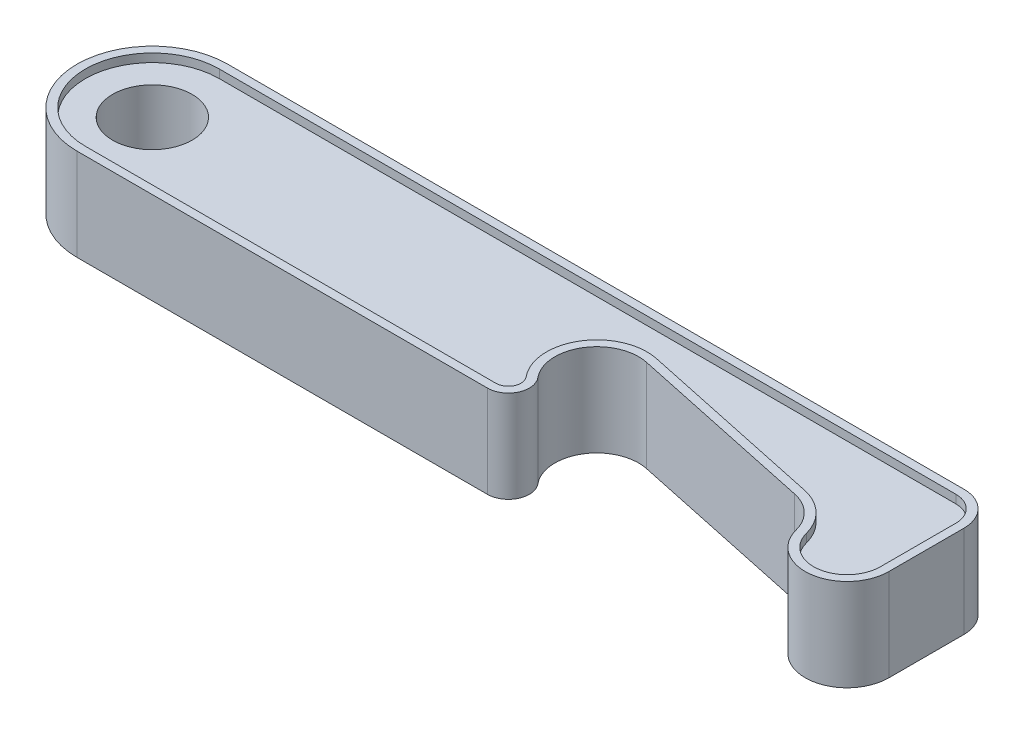
ISO-10303-21;
HEADER;
FILE_DESCRIPTION(('STEP AP214'),'2;1');
FILE_NAME('part.step','',(''),(''),'','','');
FILE_SCHEMA(('AUTOMOTIVE_DESIGN { 1 0 10303 214 1 1 1 1 }'));
ENDSEC;
DATA;
#1=APPLICATION_CONTEXT('core data for automotive mechanical design processes');
#2=APPLICATION_PROTOCOL_DEFINITION('international standard','automotive_design',2000,#1);
#3=PRODUCT_CONTEXT('',#1,'mechanical');
#4=PRODUCT('Part','Part','',(#3));
#5=PRODUCT_RELATED_PRODUCT_CATEGORY('part','',(#4));
#6=PRODUCT_DEFINITION_FORMATION('','',#4);
#7=PRODUCT_DEFINITION_CONTEXT('part definition',#1,'design');
#8=PRODUCT_DEFINITION('design','',#6,#7);
#9=PRODUCT_DEFINITION_SHAPE('','',#8);
#10=(LENGTH_UNIT() NAMED_UNIT(*) SI_UNIT(.MILLI.,.METRE.));
#11=(NAMED_UNIT(*) PLANE_ANGLE_UNIT() SI_UNIT($,.RADIAN.));
#12=(NAMED_UNIT(*) SI_UNIT($,.STERADIAN.) SOLID_ANGLE_UNIT());
#13=UNCERTAINTY_MEASURE_WITH_UNIT(LENGTH_MEASURE(1.E-05),#10,'distance_accuracy_value','');
#14=(GEOMETRIC_REPRESENTATION_CONTEXT(3) GLOBAL_UNCERTAINTY_ASSIGNED_CONTEXT((#13)) GLOBAL_UNIT_ASSIGNED_CONTEXT((#10,
#11,#12)) REPRESENTATION_CONTEXT('',''));
#15=CARTESIAN_POINT('',(0.,0.,0.));
#16=DIRECTION('',(0.,0.,1.));
#17=DIRECTION('',(1.,0.,0.));
#18=AXIS2_PLACEMENT_3D('',#15,#16,#17);
#19=CARTESIAN_POINT('',(0.,9.,0.));
#20=DIRECTION('',(0.,1.,0.));
#21=DIRECTION('',(0.,0.,1.));
#22=AXIS2_PLACEMENT_3D('',#19,#20,#21);
#23=PLANE('',#22);
#24=CARTESIAN_POINT('',(88.,9.,-5.));
#25=DIRECTION('',(0.,1.,0.));
#26=DIRECTION('',(0.,0.,1.));
#27=AXIS2_PLACEMENT_3D('',#24,#25,#26);
#28=CIRCLE('',#27,3.00000000000001);
#29=CARTESIAN_POINT('',(91.,9.,-5.));
#30=VERTEX_POINT('',#29);
#31=CARTESIAN_POINT('',(88.,9.,-8.00000000000001));
#32=VERTEX_POINT('',#31);
#33=EDGE_CURVE('E63',#30,#32,#28,.T.);
#34=ORIENTED_EDGE('',*,*,#33,.T.);
#35=DIRECTION('',(-1.,0.,0.));
#36=VECTOR('',#35,1.);
#37=CARTESIAN_POINT('',(88.,9.,-8.00000000000001));
#38=LINE('',#37,#36);
#39=CARTESIAN_POINT('',(0.,9.,-8.));
#40=VERTEX_POINT('',#39);
#41=EDGE_CURVE('E373',#32,#40,#38,.T.);
#42=ORIENTED_EDGE('',*,*,#41,.T.);
#43=CARTESIAN_POINT('',(0.,9.,0.));
#44=DIRECTION('',(0.,1.,0.));
#45=DIRECTION('',(0.,0.,1.));
#46=AXIS2_PLACEMENT_3D('',#43,#44,#45);
#47=CIRCLE('',#46,8.);
#48=CARTESIAN_POINT('',(0.,9.,8.));
#49=VERTEX_POINT('',#48);
#50=EDGE_CURVE('E375',#40,#49,#47,.T.);
#51=ORIENTED_EDGE('',*,*,#50,.T.);
#52=DIRECTION('',(1.,0.,0.));
#53=VECTOR('',#52,1.);
#54=CARTESIAN_POINT('',(0.,9.,8.));
#55=LINE('',#54,#53);
#56=CARTESIAN_POINT('',(49.0402172346334,9.,8.));
#57=VERTEX_POINT('',#56);
#58=EDGE_CURVE('E377',#49,#57,#55,.T.);
#59=ORIENTED_EDGE('',*,*,#58,.T.);
#60=CARTESIAN_POINT('',(49.0402172346334,9.,6.5));
#61=DIRECTION('',(0.,1.,0.));
#62=DIRECTION('',(0.,0.,1.));
#63=AXIS2_PLACEMENT_3D('',#60,#61,#62);
#64=CIRCLE('',#63,1.5);
#65=CARTESIAN_POINT('',(50.195682114603,9.,5.54349547248494));
#66=VERTEX_POINT('',#65);
#67=EDGE_CURVE('E379',#57,#66,#64,.T.);
#68=ORIENTED_EDGE('',*,*,#67,.T.);
#69=CARTESIAN_POINT('',(54.8175416344815,9.,1.71747736242467));
#70=DIRECTION('',(0.,-1.,0.));
#71=DIRECTION('',(0.,0.,1.));
#72=AXIS2_PLACEMENT_3D('',#69,#70,#71);
#73=CIRCLE('',#72,6.);
#74=CARTESIAN_POINT('',(56.065011779388,9.,-4.15140824197818));
#75=VERTEX_POINT('',#74);
#76=EDGE_CURVE('E381',#66,#75,#73,.T.);
#77=ORIENTED_EDGE('',*,*,#76,.T.);
#78=DIRECTION('',(0.978147600733807,0.,0.207911690817753));
#79=VECTOR('',#78,1.);
#80=CARTESIAN_POINT('',(56.065011779388,9.,-4.15140824197817));
#81=LINE('',#80,#79);
#82=CARTESIAN_POINT('',(78.565011779388,9.,0.631114395597155));
#83=VERTEX_POINT('',#82);
#84=EDGE_CURVE('E383',#75,#83,#81,.T.);
#85=ORIENTED_EDGE('',*,*,#84,.T.);
#86=CARTESIAN_POINT('',(77.3175416344814,9.,6.5));
#87=DIRECTION('',(0.,-1.,0.));
#88=DIRECTION('',(0.,0.,1.));
#89=AXIS2_PLACEMENT_3D('',#86,#87,#88);
#90=CIRCLE('',#89,6.);
#91=CARTESIAN_POINT('',(83.1270166537926,9.,5.));
#92=VERTEX_POINT('',#91);
#93=EDGE_CURVE('E385',#83,#92,#90,.T.);
#94=ORIENTED_EDGE('',*,*,#93,.T.);
#95=CARTESIAN_POINT('',(87.,9.,4.));
#96=DIRECTION('',(0.,1.,0.));
#97=DIRECTION('',(0.,0.,1.));
#98=AXIS2_PLACEMENT_3D('',#95,#96,#97);
#99=CIRCLE('',#98,4.);
#100=CARTESIAN_POINT('',(91.,9.,4.));
#101=VERTEX_POINT('',#100);
#102=EDGE_CURVE('E387',#92,#101,#99,.T.);
#103=ORIENTED_EDGE('',*,*,#102,.T.);
#104=DIRECTION('',(0.,0.,-1.));
#105=VECTOR('',#104,1.);
#106=CARTESIAN_POINT('',(91.,9.,4.));
#107=LINE('',#106,#105);
#108=EDGE_CURVE('E352',#101,#30,#107,.T.);
#109=ORIENTED_EDGE('',*,*,#108,.T.);
#110=EDGE_LOOP('',(#34,#42,#51,#59,#68,#77,#85,#94,#103,#109));
#111=FACE_BOUND('',#110,.T.);
#112=CARTESIAN_POINT('',(0.,9.,0.));
#113=DIRECTION('',(0.,1.,0.));
#114=DIRECTION('',(0.,0.,1.));
#115=AXIS2_PLACEMENT_3D('',#112,#113,#114);
#116=CIRCLE('',#115,4.75);
#117=CARTESIAN_POINT('',(0.,9.,4.75));
#118=VERTEX_POINT('',#117);
#119=EDGE_CURVE('E450',#118,#118,#116,.T.);
#120=ORIENTED_EDGE('',*,*,#119,.F.);
#121=EDGE_LOOP('',(#120));
#122=FACE_BOUND('',#121,.T.);
#123=ADVANCED_FACE('F40',(#111,#122),#23,.T.);
#124=CARTESIAN_POINT('',(0.,0.,0.));
#125=DIRECTION('',(0.,1.,0.));
#126=DIRECTION('',(0.,0.,1.));
#127=AXIS2_PLACEMENT_3D('',#124,#125,#126);
#128=PLANE('',#127);
#129=CARTESIAN_POINT('',(54.8175416344815,0.,1.71747736242467));
#130=DIRECTION('',(0.,1.,0.));
#131=DIRECTION('',(0.,0.,-1.));
#132=AXIS2_PLACEMENT_3D('',#129,#130,#131);
#133=CIRCLE('',#132,6.);
#134=CARTESIAN_POINT('',(56.065011779388,0.,-4.15140824197817));
#135=VERTEX_POINT('',#134);
#136=CARTESIAN_POINT('',(50.195682114603,0.,5.54349547248494));
#137=VERTEX_POINT('',#136);
#138=EDGE_CURVE('E246',#135,#137,#133,.T.);
#139=ORIENTED_EDGE('',*,*,#138,.T.);
#140=CARTESIAN_POINT('',(49.0402172346334,0.,6.5));
#141=DIRECTION('',(0.,-1.,0.));
#142=DIRECTION('',(0.,0.,-1.));
#143=AXIS2_PLACEMENT_3D('',#140,#141,#142);
#144=CIRCLE('',#143,1.5);
#145=CARTESIAN_POINT('',(49.0402172346334,0.,8.00000000000001));
#146=VERTEX_POINT('',#145);
#147=EDGE_CURVE('E278',#137,#146,#144,.T.);
#148=ORIENTED_EDGE('',*,*,#147,.T.);
#149=DIRECTION('',(-1.,0.,0.));
#150=VECTOR('',#149,1.);
#151=CARTESIAN_POINT('',(49.0402172346334,0.,8.00000000000001));
#152=LINE('',#151,#150);
#153=CARTESIAN_POINT('',(0.,0.,8.));
#154=VERTEX_POINT('',#153);
#155=EDGE_CURVE('E252',#146,#154,#152,.T.);
#156=ORIENTED_EDGE('',*,*,#155,.T.);
#157=CARTESIAN_POINT('',(0.,0.,0.));
#158=DIRECTION('',(0.,-1.,0.));
#159=DIRECTION('',(0.,0.,-1.));
#160=AXIS2_PLACEMENT_3D('',#157,#158,#159);
#161=CIRCLE('',#160,8.);
#162=CARTESIAN_POINT('',(0.,0.,-8.));
#163=VERTEX_POINT('',#162);
#164=EDGE_CURVE('E281',#154,#163,#161,.T.);
#165=ORIENTED_EDGE('',*,*,#164,.T.);
#166=DIRECTION('',(1.,0.,0.));
#167=VECTOR('',#166,1.);
#168=CARTESIAN_POINT('',(0.,0.,-8.));
#169=LINE('',#168,#167);
#170=CARTESIAN_POINT('',(88.,0.,-7.99999999999999));
#171=VERTEX_POINT('',#170);
#172=EDGE_CURVE('E284',#163,#171,#169,.T.);
#173=ORIENTED_EDGE('',*,*,#172,.T.);
#174=CARTESIAN_POINT('',(88.,0.,-5.));
#175=DIRECTION('',(0.,-1.,0.));
#176=DIRECTION('',(0.,0.,-1.));
#177=AXIS2_PLACEMENT_3D('',#174,#175,#176);
#178=CIRCLE('',#177,3.);
#179=CARTESIAN_POINT('',(91.,0.,-5.));
#180=VERTEX_POINT('',#179);
#181=EDGE_CURVE('E287',#171,#180,#178,.T.);
#182=ORIENTED_EDGE('',*,*,#181,.T.);
#183=DIRECTION('',(0.,0.,1.));
#184=VECTOR('',#183,1.);
#185=CARTESIAN_POINT('',(91.,0.,-5.));
#186=LINE('',#185,#184);
#187=CARTESIAN_POINT('',(91.,0.,4.));
#188=VERTEX_POINT('',#187);
#189=EDGE_CURVE('E290',#180,#188,#186,.T.);
#190=ORIENTED_EDGE('',*,*,#189,.T.);
#191=CARTESIAN_POINT('',(87.,0.,4.));
#192=DIRECTION('',(0.,-1.,0.));
#193=DIRECTION('',(0.,0.,-1.));
#194=AXIS2_PLACEMENT_3D('',#191,#192,#193);
#195=CIRCLE('',#194,4.);
#196=CARTESIAN_POINT('',(83.1270166537926,0.,5.));
#197=VERTEX_POINT('',#196);
#198=EDGE_CURVE('E293',#188,#197,#195,.T.);
#199=ORIENTED_EDGE('',*,*,#198,.T.);
#200=CARTESIAN_POINT('',(77.3175416344814,0.,6.5));
#201=DIRECTION('',(0.,1.,0.));
#202=DIRECTION('',(0.,0.,-1.));
#203=AXIS2_PLACEMENT_3D('',#200,#201,#202);
#204=CIRCLE('',#203,6.);
#205=CARTESIAN_POINT('',(78.565011779388,0.,0.631114395597154));
#206=VERTEX_POINT('',#205);
#207=EDGE_CURVE('E296',#197,#206,#204,.T.);
#208=ORIENTED_EDGE('',*,*,#207,.T.);
#209=DIRECTION('',(-0.978147600733807,0.,-0.207911690817752));
#210=VECTOR('',#209,1.);
#211=CARTESIAN_POINT('',(78.565011779388,0.,0.631114395597158));
#212=LINE('',#211,#210);
#213=EDGE_CURVE('E299',#206,#135,#212,.T.);
#214=ORIENTED_EDGE('',*,*,#213,.T.);
#215=EDGE_LOOP('',(#139,#148,#156,#165,#173,#182,#190,#199,#208,#214));
#216=FACE_BOUND('',#215,.T.);
#217=CARTESIAN_POINT('',(0.,0.,0.));
#218=DIRECTION('',(0.,1.,0.));
#219=DIRECTION('',(0.,0.,1.));
#220=AXIS2_PLACEMENT_3D('',#217,#218,#219);
#221=CIRCLE('',#220,4.75);
#222=CARTESIAN_POINT('',(0.,0.,4.75));
#223=VERTEX_POINT('',#222);
#224=EDGE_CURVE('E449',#223,#223,#221,.T.);
#225=ORIENTED_EDGE('',*,*,#224,.T.);
#226=EDGE_LOOP('',(#225));
#227=FACE_BOUND('',#226,.T.);
#228=ADVANCED_FACE('F521',(#216,#227),#128,.F.);
#229=CARTESIAN_POINT('',(0.,9.,0.));
#230=DIRECTION('',(0.,-1.,0.));
#231=DIRECTION('',(0.,0.,-1.));
#232=AXIS2_PLACEMENT_3D('',#229,#230,#231);
#233=CYLINDRICAL_SURFACE('',#232,9.);
#234=DIRECTION('',(0.,-1.,0.));
#235=VECTOR('',#234,1.);
#236=CARTESIAN_POINT('',(0.,9.,-9.));
#237=LINE('',#236,#235);
#238=CARTESIAN_POINT('',(0.,10.,-9.));
#239=VERTEX_POINT('',#238);
#240=CARTESIAN_POINT('',(0.,-1.,-9.));
#241=VERTEX_POINT('',#240);
#242=EDGE_CURVE('E453',#239,#241,#237,.T.);
#243=ORIENTED_EDGE('',*,*,#242,.T.);
#244=CARTESIAN_POINT('',(0.,-1.,0.));
#245=DIRECTION('',(0.,-1.,0.));
#246=DIRECTION('',(0.,0.,-1.));
#247=AXIS2_PLACEMENT_3D('',#244,#245,#246);
#248=CIRCLE('',#247,9.);
#249=CARTESIAN_POINT('',(0.,-1.,9.));
#250=VERTEX_POINT('',#249);
#251=EDGE_CURVE('E253',#250,#241,#248,.T.);
#252=ORIENTED_EDGE('',*,*,#251,.F.);
#253=DIRECTION('',(0.,-1.,0.));
#254=VECTOR('',#253,1.);
#255=CARTESIAN_POINT('',(0.,9.,9.));
#256=LINE('',#255,#254);
#257=CARTESIAN_POINT('',(0.,10.,9.));
#258=VERTEX_POINT('',#257);
#259=EDGE_CURVE('E11',#258,#250,#256,.T.);
#260=ORIENTED_EDGE('',*,*,#259,.F.);
#261=CARTESIAN_POINT('',(0.,10.,0.));
#262=DIRECTION('',(0.,1.,0.));
#263=DIRECTION('',(0.,0.,1.));
#264=AXIS2_PLACEMENT_3D('',#261,#262,#263);
#265=CIRCLE('',#264,9.);
#266=EDGE_CURVE('E419',#239,#258,#265,.T.);
#267=ORIENTED_EDGE('',*,*,#266,.F.);
#268=EDGE_LOOP('',(#243,#252,#260,#267));
#269=FACE_BOUND('',#268,.T.);
#270=ADVANCED_FACE('F42',(#269),#233,.T.);
#271=CARTESIAN_POINT('',(0.,9.,9.));
#272=DIRECTION('',(0.,0.,-1.));
#273=DIRECTION('',(-1.,0.,0.));
#274=AXIS2_PLACEMENT_3D('',#271,#272,#273);
#275=PLANE('',#274);
#276=ORIENTED_EDGE('',*,*,#259,.T.);
#277=DIRECTION('',(-1.,0.,0.));
#278=VECTOR('',#277,1.);
#279=CARTESIAN_POINT('',(49.0402172346334,-1.,9.));
#280=LINE('',#279,#278);
#281=CARTESIAN_POINT('',(49.0402172346334,-1.,9.));
#282=VERTEX_POINT('',#281);
#283=EDGE_CURVE('E346',#282,#250,#280,.T.);
#284=ORIENTED_EDGE('',*,*,#283,.F.);
#285=DIRECTION('',(0.,-1.,0.));
#286=VECTOR('',#285,1.);
#287=CARTESIAN_POINT('',(49.0402172346334,9.,9.));
#288=LINE('',#287,#286);
#289=CARTESIAN_POINT('',(49.0402172346334,10.,9.));
#290=VERTEX_POINT('',#289);
#291=EDGE_CURVE('E48',#290,#282,#288,.T.);
#292=ORIENTED_EDGE('',*,*,#291,.F.);
#293=DIRECTION('',(1.,0.,0.));
#294=VECTOR('',#293,1.);
#295=CARTESIAN_POINT('',(0.,10.,9.));
#296=LINE('',#295,#294);
#297=EDGE_CURVE('E422',#258,#290,#296,.T.);
#298=ORIENTED_EDGE('',*,*,#297,.F.);
#299=EDGE_LOOP('',(#276,#284,#292,#298));
#300=FACE_BOUND('',#299,.T.);
#301=ADVANCED_FACE('F480',(#300),#275,.F.);
#302=CARTESIAN_POINT('',(49.0402172346334,9.,6.5));
#303=DIRECTION('',(0.,-1.,0.));
#304=DIRECTION('',(0.,0.,-1.));
#305=AXIS2_PLACEMENT_3D('',#302,#303,#304);
#306=CYLINDRICAL_SURFACE('',#305,2.5);
#307=ORIENTED_EDGE('',*,*,#291,.T.);
#308=CARTESIAN_POINT('',(49.0402172346334,-1.,6.5));
#309=DIRECTION('',(0.,-1.,0.));
#310=DIRECTION('',(0.,0.,-1.));
#311=AXIS2_PLACEMENT_3D('',#308,#309,#310);
#312=CIRCLE('',#311,2.5);
#313=CARTESIAN_POINT('',(50.9659920345828,-1.,4.90582578747489));
#314=VERTEX_POINT('',#313);
#315=EDGE_CURVE('E343',#314,#282,#312,.T.);
#316=ORIENTED_EDGE('',*,*,#315,.F.);
#317=DIRECTION('',(0.,-1.,0.));
#318=VECTOR('',#317,1.);
#319=CARTESIAN_POINT('',(50.9659920345828,9.,4.90582578747489));
#320=LINE('',#319,#318);
#321=CARTESIAN_POINT('',(50.9659920345828,10.,4.90582578747489));
#322=VERTEX_POINT('',#321);
#323=EDGE_CURVE('E469',#322,#314,#320,.T.);
#324=ORIENTED_EDGE('',*,*,#323,.F.);
#325=CARTESIAN_POINT('',(49.0402172346334,10.,6.5));
#326=DIRECTION('',(0.,1.,0.));
#327=DIRECTION('',(0.,0.,1.));
#328=AXIS2_PLACEMENT_3D('',#325,#326,#327);
#329=CIRCLE('',#328,2.5);
#330=EDGE_CURVE('E425',#290,#322,#329,.T.);
#331=ORIENTED_EDGE('',*,*,#330,.F.);
#332=EDGE_LOOP('',(#307,#316,#324,#331));
#333=FACE_BOUND('',#332,.T.);
#334=ADVANCED_FACE('F473',(#333),#306,.T.);
#335=CARTESIAN_POINT('',(54.8175416344815,9.,1.71747736242467));
#336=DIRECTION('',(0.,-1.,0.));
#337=DIRECTION('',(0.,0.,-1.));
#338=AXIS2_PLACEMENT_3D('',#335,#336,#337);
#339=CYLINDRICAL_SURFACE('',#338,5.);
#340=ORIENTED_EDGE('',*,*,#323,.T.);
#341=CARTESIAN_POINT('',(54.8175416344815,-1.,1.71747736242467));
#342=DIRECTION('',(0.,1.,0.));
#343=DIRECTION('',(0.,0.,-1.));
#344=AXIS2_PLACEMENT_3D('',#341,#342,#343);
#345=CIRCLE('',#344,4.99999999999999);
#346=CARTESIAN_POINT('',(55.8571000885702,-1.,-3.17326064124436));
#347=VERTEX_POINT('',#346);
#348=EDGE_CURVE('E340',#347,#314,#345,.T.);
#349=ORIENTED_EDGE('',*,*,#348,.F.);
#350=DIRECTION('',(0.,-1.,0.));
#351=VECTOR('',#350,1.);
#352=CARTESIAN_POINT('',(55.8571000885702,9.,-3.17326064124436));
#353=LINE('',#352,#351);
#354=CARTESIAN_POINT('',(55.8571000885702,10.,-3.17326064124436));
#355=VERTEX_POINT('',#354);
#356=EDGE_CURVE('E467',#355,#347,#353,.T.);
#357=ORIENTED_EDGE('',*,*,#356,.F.);
#358=CARTESIAN_POINT('',(54.8175416344815,10.,1.71747736242467));
#359=DIRECTION('',(0.,-1.,0.));
#360=DIRECTION('',(0.,0.,1.));
#361=AXIS2_PLACEMENT_3D('',#358,#359,#360);
#362=CIRCLE('',#361,4.99999999999999);
#363=EDGE_CURVE('E428',#322,#355,#362,.T.);
#364=ORIENTED_EDGE('',*,*,#363,.F.);
#365=EDGE_LOOP('',(#340,#349,#357,#364));
#366=FACE_BOUND('',#365,.T.);
#367=ADVANCED_FACE('F511',(#366),#339,.F.);
#368=CARTESIAN_POINT('',(55.8571000885702,9.,-3.17326064124437));
#369=DIRECTION('',(0.207911690817753,0.,-0.978147600733807));
#370=DIRECTION('',(-0.978147600733807,0.,-0.207911690817753));
#371=AXIS2_PLACEMENT_3D('',#368,#369,#370);
#372=PLANE('',#371);
#373=ORIENTED_EDGE('',*,*,#356,.T.);
#374=DIRECTION('',(-0.978147600733807,0.,-0.207911690817752));
#375=VECTOR('',#374,1.);
#376=CARTESIAN_POINT('',(78.3571000885702,-1.,1.60926199633096));
#377=LINE('',#376,#375);
#378=CARTESIAN_POINT('',(78.3571000885702,-1.,1.60926199633096));
#379=VERTEX_POINT('',#378);
#380=EDGE_CURVE('E337',#379,#347,#377,.T.);
#381=ORIENTED_EDGE('',*,*,#380,.F.);
#382=DIRECTION('',(0.,-1.,0.));
#383=VECTOR('',#382,1.);
#384=CARTESIAN_POINT('',(78.3571000885702,9.,1.60926199633096));
#385=LINE('',#384,#383);
#386=CARTESIAN_POINT('',(78.3571000885702,10.,1.60926199633096));
#387=VERTEX_POINT('',#386);
#388=EDGE_CURVE('E465',#387,#379,#385,.T.);
#389=ORIENTED_EDGE('',*,*,#388,.F.);
#390=DIRECTION('',(0.978147600733807,0.,0.207911690817752));
#391=VECTOR('',#390,1.);
#392=CARTESIAN_POINT('',(55.8571000885702,10.,-3.17326064124436));
#393=LINE('',#392,#391);
#394=EDGE_CURVE('E431',#355,#387,#393,.T.);
#395=ORIENTED_EDGE('',*,*,#394,.F.);
#396=EDGE_LOOP('',(#373,#381,#389,#395));
#397=FACE_BOUND('',#396,.T.);
#398=ADVANCED_FACE('F508',(#397),#372,.F.);
#399=CARTESIAN_POINT('',(77.3175416344814,9.,6.5));
#400=DIRECTION('',(0.,-1.,0.));
#401=DIRECTION('',(0.,0.,-1.));
#402=AXIS2_PLACEMENT_3D('',#399,#400,#401);
#403=CYLINDRICAL_SURFACE('',#402,5.);
#404=ORIENTED_EDGE('',*,*,#388,.T.);
#405=CARTESIAN_POINT('',(77.3175416344814,-1.,6.5));
#406=DIRECTION('',(0.,1.,0.));
#407=DIRECTION('',(0.,0.,-1.));
#408=AXIS2_PLACEMENT_3D('',#405,#406,#407);
#409=CIRCLE('',#408,5.);
#410=CARTESIAN_POINT('',(82.1587708172407,-1.,5.25));
#411=VERTEX_POINT('',#410);
#412=EDGE_CURVE('E334',#411,#379,#409,.T.);
#413=ORIENTED_EDGE('',*,*,#412,.F.);
#414=DIRECTION('',(0.,-1.,0.));
#415=VECTOR('',#414,1.);
#416=CARTESIAN_POINT('',(82.1587708172407,9.,5.25));
#417=LINE('',#416,#415);
#418=CARTESIAN_POINT('',(82.1587708172407,10.,5.25));
#419=VERTEX_POINT('',#418);
#420=EDGE_CURVE('E463',#419,#411,#417,.T.);
#421=ORIENTED_EDGE('',*,*,#420,.F.);
#422=CARTESIAN_POINT('',(77.3175416344814,10.,6.5));
#423=DIRECTION('',(0.,-1.,0.));
#424=DIRECTION('',(0.,0.,1.));
#425=AXIS2_PLACEMENT_3D('',#422,#423,#424);
#426=CIRCLE('',#425,5.);
#427=EDGE_CURVE('E434',#387,#419,#426,.T.);
#428=ORIENTED_EDGE('',*,*,#427,.F.);
#429=EDGE_LOOP('',(#404,#413,#421,#428));
#430=FACE_BOUND('',#429,.T.);
#431=ADVANCED_FACE('F505',(#430),#403,.F.);
#432=CARTESIAN_POINT('',(87.,9.,4.));
#433=DIRECTION('',(0.,-1.,0.));
#434=DIRECTION('',(0.,0.,-1.));
#435=AXIS2_PLACEMENT_3D('',#432,#433,#434);
#436=CYLINDRICAL_SURFACE('',#435,5.00000000000001);
#437=ORIENTED_EDGE('',*,*,#420,.T.);
#438=CARTESIAN_POINT('',(87.,-1.,4.));
#439=DIRECTION('',(0.,-1.,0.));
#440=DIRECTION('',(0.,0.,-1.));
#441=AXIS2_PLACEMENT_3D('',#438,#439,#440);
#442=CIRCLE('',#441,5.00000000000001);
#443=CARTESIAN_POINT('',(92.,-1.,4.));
#444=VERTEX_POINT('',#443);
#445=EDGE_CURVE('E331',#444,#411,#442,.T.);
#446=ORIENTED_EDGE('',*,*,#445,.F.);
#447=DIRECTION('',(0.,-1.,0.));
#448=VECTOR('',#447,1.);
#449=CARTESIAN_POINT('',(92.,9.,4.));
#450=LINE('',#449,#448);
#451=CARTESIAN_POINT('',(92.,10.,4.));
#452=VERTEX_POINT('',#451);
#453=EDGE_CURVE('E461',#452,#444,#450,.T.);
#454=ORIENTED_EDGE('',*,*,#453,.F.);
#455=CARTESIAN_POINT('',(87.,10.,4.));
#456=DIRECTION('',(0.,1.,0.));
#457=DIRECTION('',(0.,0.,1.));
#458=AXIS2_PLACEMENT_3D('',#455,#456,#457);
#459=CIRCLE('',#458,5.00000000000001);
#460=EDGE_CURVE('E437',#419,#452,#459,.T.);
#461=ORIENTED_EDGE('',*,*,#460,.F.);
#462=EDGE_LOOP('',(#437,#446,#454,#461));
#463=FACE_BOUND('',#462,.T.);
#464=ADVANCED_FACE('F500',(#463),#436,.T.);
#465=CARTESIAN_POINT('',(92.,9.,4.));
#466=DIRECTION('',(-1.,0.,0.));
#467=DIRECTION('',(0.,0.,1.));
#468=AXIS2_PLACEMENT_3D('',#465,#466,#467);
#469=PLANE('',#468);
#470=ORIENTED_EDGE('',*,*,#453,.T.);
#471=DIRECTION('',(0.,0.,1.));
#472=VECTOR('',#471,1.);
#473=CARTESIAN_POINT('',(92.,-1.,-5.));
#474=LINE('',#473,#472);
#475=CARTESIAN_POINT('',(92.,-1.,-5.));
#476=VERTEX_POINT('',#475);
#477=EDGE_CURVE('E328',#476,#444,#474,.T.);
#478=ORIENTED_EDGE('',*,*,#477,.F.);
#479=DIRECTION('',(0.,-1.,0.));
#480=VECTOR('',#479,1.);
#481=CARTESIAN_POINT('',(92.,9.,-5.));
#482=LINE('',#481,#480);
#483=CARTESIAN_POINT('',(92.,10.,-5.));
#484=VERTEX_POINT('',#483);
#485=EDGE_CURVE('E459',#484,#476,#482,.T.);
#486=ORIENTED_EDGE('',*,*,#485,.F.);
#487=DIRECTION('',(0.,0.,-1.));
#488=VECTOR('',#487,1.);
#489=CARTESIAN_POINT('',(92.,10.,4.));
#490=LINE('',#489,#488);
#491=EDGE_CURVE('E440',#452,#484,#490,.T.);
#492=ORIENTED_EDGE('',*,*,#491,.F.);
#493=EDGE_LOOP('',(#470,#478,#486,#492));
#494=FACE_BOUND('',#493,.T.);
#495=ADVANCED_FACE('F492',(#494),#469,.F.);
#496=CARTESIAN_POINT('',(88.,9.,-5.));
#497=DIRECTION('',(0.,-1.,0.));
#498=DIRECTION('',(0.,0.,-1.));
#499=AXIS2_PLACEMENT_3D('',#496,#497,#498);
#500=CYLINDRICAL_SURFACE('',#499,4.);
#501=ORIENTED_EDGE('',*,*,#485,.T.);
#502=CARTESIAN_POINT('',(88.,-1.,-5.));
#503=DIRECTION('',(0.,-1.,0.));
#504=DIRECTION('',(0.,0.,-1.));
#505=AXIS2_PLACEMENT_3D('',#502,#503,#504);
#506=CIRCLE('',#505,4.);
#507=CARTESIAN_POINT('',(88.,-1.,-9.));
#508=VERTEX_POINT('',#507);
#509=EDGE_CURVE('E325',#508,#476,#506,.T.);
#510=ORIENTED_EDGE('',*,*,#509,.F.);
#511=DIRECTION('',(0.,-1.,0.));
#512=VECTOR('',#511,1.);
#513=CARTESIAN_POINT('',(88.,9.,-9.));
#514=LINE('',#513,#512);
#515=CARTESIAN_POINT('',(88.,10.,-9.));
#516=VERTEX_POINT('',#515);
#517=EDGE_CURVE('E457',#516,#508,#514,.T.);
#518=ORIENTED_EDGE('',*,*,#517,.F.);
#519=CARTESIAN_POINT('',(88.,10.,-5.));
#520=DIRECTION('',(0.,1.,0.));
#521=DIRECTION('',(0.,0.,1.));
#522=AXIS2_PLACEMENT_3D('',#519,#520,#521);
#523=CIRCLE('',#522,4.);
#524=EDGE_CURVE('E443',#484,#516,#523,.T.);
#525=ORIENTED_EDGE('',*,*,#524,.F.);
#526=EDGE_LOOP('',(#501,#510,#518,#525));
#527=FACE_BOUND('',#526,.T.);
#528=ADVANCED_FACE('F488',(#527),#500,.T.);
#529=CARTESIAN_POINT('',(0.,9.,-9.));
#530=DIRECTION('',(0.,0.,1.));
#531=DIRECTION('',(1.,0.,0.));
#532=AXIS2_PLACEMENT_3D('',#529,#530,#531);
#533=PLANE('',#532);
#534=ORIENTED_EDGE('',*,*,#517,.T.);
#535=DIRECTION('',(1.,0.,0.));
#536=VECTOR('',#535,1.);
#537=CARTESIAN_POINT('',(0.,-1.,-9.));
#538=LINE('',#537,#536);
#539=EDGE_CURVE('E322',#241,#508,#538,.T.);
#540=ORIENTED_EDGE('',*,*,#539,.F.);
#541=ORIENTED_EDGE('',*,*,#242,.F.);
#542=DIRECTION('',(-1.,0.,0.));
#543=VECTOR('',#542,1.);
#544=CARTESIAN_POINT('',(88.,10.,-9.));
#545=LINE('',#544,#543);
#546=EDGE_CURVE('E446',#516,#239,#545,.T.);
#547=ORIENTED_EDGE('',*,*,#546,.F.);
#548=EDGE_LOOP('',(#534,#540,#541,#547));
#549=FACE_BOUND('',#548,.T.);
#550=ADVANCED_FACE('F533',(#549),#533,.F.);
#551=CARTESIAN_POINT('',(0.,9.,0.));
#552=DIRECTION('',(0.,-1.,0.));
#553=DIRECTION('',(0.,0.,-1.));
#554=AXIS2_PLACEMENT_3D('',#551,#552,#553);
#555=CYLINDRICAL_SURFACE('',#554,4.75);
#556=ORIENTED_EDGE('',*,*,#119,.T.);
#557=EDGE_LOOP('',(#556));
#558=FACE_BOUND('',#557,.T.);
#559=ORIENTED_EDGE('',*,*,#224,.F.);
#560=EDGE_LOOP('',(#559));
#561=FACE_BOUND('',#560,.T.);
#562=ADVANCED_FACE('F530',(#558,#561),#555,.F.);
#563=CARTESIAN_POINT('',(0.,10.,0.));
#564=DIRECTION('',(0.,1.,0.));
#565=DIRECTION('',(0.,0.,1.));
#566=AXIS2_PLACEMENT_3D('',#563,#564,#565);
#567=PLANE('',#566);
#568=ORIENTED_EDGE('',*,*,#266,.T.);
#569=ORIENTED_EDGE('',*,*,#297,.T.);
#570=ORIENTED_EDGE('',*,*,#330,.T.);
#571=ORIENTED_EDGE('',*,*,#363,.T.);
#572=ORIENTED_EDGE('',*,*,#394,.T.);
#573=ORIENTED_EDGE('',*,*,#427,.T.);
#574=ORIENTED_EDGE('',*,*,#460,.T.);
#575=ORIENTED_EDGE('',*,*,#491,.T.);
#576=ORIENTED_EDGE('',*,*,#524,.T.);
#577=ORIENTED_EDGE('',*,*,#546,.T.);
#578=EDGE_LOOP('',(#568,#569,#570,#571,#572,#573,#574,#575,#576,#577));
#579=FACE_BOUND('',#578,.T.);
#580=DIRECTION('',(-1.,0.,0.));
#581=VECTOR('',#580,1.);
#582=CARTESIAN_POINT('',(88.,10.,-8.00000000000001));
#583=LINE('',#582,#581);
#584=CARTESIAN_POINT('',(88.,10.,-8.00000000000001));
#585=VERTEX_POINT('',#584);
#586=CARTESIAN_POINT('',(0.,10.,-8.));
#587=VERTEX_POINT('',#586);
#588=EDGE_CURVE('E351',#585,#587,#583,.T.);
#589=ORIENTED_EDGE('',*,*,#588,.F.);
#590=CARTESIAN_POINT('',(88.,10.,-5.));
#591=DIRECTION('',(0.,1.,0.));
#592=DIRECTION('',(0.,0.,1.));
#593=AXIS2_PLACEMENT_3D('',#590,#591,#592);
#594=CIRCLE('',#593,3.00000000000001);
#595=CARTESIAN_POINT('',(91.,10.,-5.));
#596=VERTEX_POINT('',#595);
#597=EDGE_CURVE('E349',#596,#585,#594,.T.);
#598=ORIENTED_EDGE('',*,*,#597,.F.);
#599=DIRECTION('',(0.,0.,-1.));
#600=VECTOR('',#599,1.);
#601=CARTESIAN_POINT('',(91.,10.,4.));
#602=LINE('',#601,#600);
#603=CARTESIAN_POINT('',(91.,10.,4.));
#604=VERTEX_POINT('',#603);
#605=EDGE_CURVE('E369',#604,#596,#602,.T.);
#606=ORIENTED_EDGE('',*,*,#605,.F.);
#607=CARTESIAN_POINT('',(87.,10.,4.));
#608=DIRECTION('',(0.,1.,0.));
#609=DIRECTION('',(0.,0.,1.));
#610=AXIS2_PLACEMENT_3D('',#607,#608,#609);
#611=CIRCLE('',#610,4.);
#612=CARTESIAN_POINT('',(83.1270166537926,10.,5.));
#613=VERTEX_POINT('',#612);
#614=EDGE_CURVE('E366',#613,#604,#611,.T.);
#615=ORIENTED_EDGE('',*,*,#614,.F.);
#616=CARTESIAN_POINT('',(77.3175416344814,10.,6.5));
#617=DIRECTION('',(0.,-1.,0.));
#618=DIRECTION('',(0.,0.,1.));
#619=AXIS2_PLACEMENT_3D('',#616,#617,#618);
#620=CIRCLE('',#619,6.);
#621=CARTESIAN_POINT('',(78.565011779388,10.,0.631114395597158));
#622=VERTEX_POINT('',#621);
#623=EDGE_CURVE('E364',#622,#613,#620,.T.);
#624=ORIENTED_EDGE('',*,*,#623,.F.);
#625=DIRECTION('',(0.978147600733807,0.,0.207911690817753));
#626=VECTOR('',#625,1.);
#627=CARTESIAN_POINT('',(56.065011779388,10.,-4.15140824197817));
#628=LINE('',#627,#626);
#629=CARTESIAN_POINT('',(56.065011779388,10.,-4.15140824197817));
#630=VERTEX_POINT('',#629);
#631=EDGE_CURVE('E362',#630,#622,#628,.T.);
#632=ORIENTED_EDGE('',*,*,#631,.F.);
#633=CARTESIAN_POINT('',(54.8175416344815,10.,1.71747736242467));
#634=DIRECTION('',(0.,-1.,0.));
#635=DIRECTION('',(0.,0.,1.));
#636=AXIS2_PLACEMENT_3D('',#633,#634,#635);
#637=CIRCLE('',#636,6.);
#638=CARTESIAN_POINT('',(50.195682114603,10.,5.54349547248494));
#639=VERTEX_POINT('',#638);
#640=EDGE_CURVE('E360',#639,#630,#637,.T.);
#641=ORIENTED_EDGE('',*,*,#640,.F.);
#642=CARTESIAN_POINT('',(49.0402172346334,10.,6.5));
#643=DIRECTION('',(0.,1.,0.));
#644=DIRECTION('',(0.,0.,1.));
#645=AXIS2_PLACEMENT_3D('',#642,#643,#644);
#646=CIRCLE('',#645,1.5);
#647=CARTESIAN_POINT('',(49.0402172346334,10.,8.));
#648=VERTEX_POINT('',#647);
#649=EDGE_CURVE('E358',#648,#639,#646,.T.);
#650=ORIENTED_EDGE('',*,*,#649,.F.);
#651=DIRECTION('',(1.,0.,0.));
#652=VECTOR('',#651,1.);
#653=CARTESIAN_POINT('',(0.,10.,8.));
#654=LINE('',#653,#652);
#655=CARTESIAN_POINT('',(0.,10.,8.));
#656=VERTEX_POINT('',#655);
#657=EDGE_CURVE('E356',#656,#648,#654,.T.);
#658=ORIENTED_EDGE('',*,*,#657,.F.);
#659=CARTESIAN_POINT('',(0.,10.,0.));
#660=DIRECTION('',(0.,1.,0.));
#661=DIRECTION('',(0.,0.,1.));
#662=AXIS2_PLACEMENT_3D('',#659,#660,#661);
#663=CIRCLE('',#662,8.);
#664=EDGE_CURVE('E354',#587,#656,#663,.T.);
#665=ORIENTED_EDGE('',*,*,#664,.F.);
#666=EDGE_LOOP('',(#589,#598,#606,#615,#624,#632,#641,#650,#658,#665));
#667=FACE_BOUND('',#666,.T.);
#668=ADVANCED_FACE('F494',(#579,#667),#567,.T.);
#669=CARTESIAN_POINT('',(88.,10.,-5.));
#670=DIRECTION('',(0.,-1.,0.));
#671=DIRECTION('',(0.,0.,-1.));
#672=AXIS2_PLACEMENT_3D('',#669,#670,#671);
#673=CYLINDRICAL_SURFACE('',#672,3.00000000000001);
#674=ORIENTED_EDGE('',*,*,#33,.F.);
#675=DIRECTION('',(0.,-1.,0.));
#676=VECTOR('',#675,1.);
#677=CARTESIAN_POINT('',(91.,10.,-5.));
#678=LINE('',#677,#676);
#679=EDGE_CURVE('E371',#596,#30,#678,.T.);
#680=ORIENTED_EDGE('',*,*,#679,.F.);
#681=ORIENTED_EDGE('',*,*,#597,.T.);
#682=DIRECTION('',(0.,-1.,0.));
#683=VECTOR('',#682,1.);
#684=CARTESIAN_POINT('',(88.,10.,-8.00000000000001));
#685=LINE('',#684,#683);
#686=EDGE_CURVE('E416',#585,#32,#685,.T.);
#687=ORIENTED_EDGE('',*,*,#686,.T.);
#688=EDGE_LOOP('',(#674,#680,#681,#687));
#689=FACE_BOUND('',#688,.T.);
#690=ADVANCED_FACE('F576',(#689),#673,.F.);
#691=CARTESIAN_POINT('',(88.,10.,-8.00000000000001));
#692=DIRECTION('',(0.,0.,1.));
#693=DIRECTION('',(1.,0.,0.));
#694=AXIS2_PLACEMENT_3D('',#691,#692,#693);
#695=PLANE('',#694);
#696=ORIENTED_EDGE('',*,*,#41,.F.);
#697=ORIENTED_EDGE('',*,*,#686,.F.);
#698=ORIENTED_EDGE('',*,*,#588,.T.);
#699=DIRECTION('',(0.,-1.,0.));
#700=VECTOR('',#699,1.);
#701=CARTESIAN_POINT('',(0.,10.,-8.));
#702=LINE('',#701,#700);
#703=EDGE_CURVE('E413',#587,#40,#702,.T.);
#704=ORIENTED_EDGE('',*,*,#703,.T.);
#705=EDGE_LOOP('',(#696,#697,#698,#704));
#706=FACE_BOUND('',#705,.T.);
#707=ADVANCED_FACE('F582',(#706),#695,.T.);
#708=CARTESIAN_POINT('',(0.,10.,0.));
#709=DIRECTION('',(0.,-1.,0.));
#710=DIRECTION('',(0.,0.,-1.));
#711=AXIS2_PLACEMENT_3D('',#708,#709,#710);
#712=CYLINDRICAL_SURFACE('',#711,8.);
#713=ORIENTED_EDGE('',*,*,#50,.F.);
#714=ORIENTED_EDGE('',*,*,#703,.F.);
#715=ORIENTED_EDGE('',*,*,#664,.T.);
#716=DIRECTION('',(0.,-1.,0.));
#717=VECTOR('',#716,1.);
#718=CARTESIAN_POINT('',(0.,10.,8.));
#719=LINE('',#718,#717);
#720=EDGE_CURVE('E410',#656,#49,#719,.T.);
#721=ORIENTED_EDGE('',*,*,#720,.T.);
#722=EDGE_LOOP('',(#713,#714,#715,#721));
#723=FACE_BOUND('',#722,.T.);
#724=ADVANCED_FACE('F590',(#723),#712,.F.);
#725=CARTESIAN_POINT('',(0.,10.,8.));
#726=DIRECTION('',(0.,0.,-1.));
#727=DIRECTION('',(-1.,0.,0.));
#728=AXIS2_PLACEMENT_3D('',#725,#726,#727);
#729=PLANE('',#728);
#730=ORIENTED_EDGE('',*,*,#58,.F.);
#731=ORIENTED_EDGE('',*,*,#720,.F.);
#732=ORIENTED_EDGE('',*,*,#657,.T.);
#733=DIRECTION('',(0.,-1.,0.));
#734=VECTOR('',#733,1.);
#735=CARTESIAN_POINT('',(49.0402172346334,10.,8.));
#736=LINE('',#735,#734);
#737=EDGE_CURVE('E407',#648,#57,#736,.T.);
#738=ORIENTED_EDGE('',*,*,#737,.T.);
#739=EDGE_LOOP('',(#730,#731,#732,#738));
#740=FACE_BOUND('',#739,.T.);
#741=ADVANCED_FACE('F598',(#740),#729,.T.);
#742=CARTESIAN_POINT('',(49.0402172346334,10.,6.5));
#743=DIRECTION('',(0.,-1.,0.));
#744=DIRECTION('',(0.,0.,-1.));
#745=AXIS2_PLACEMENT_3D('',#742,#743,#744);
#746=CYLINDRICAL_SURFACE('',#745,1.5);
#747=ORIENTED_EDGE('',*,*,#67,.F.);
#748=ORIENTED_EDGE('',*,*,#737,.F.);
#749=ORIENTED_EDGE('',*,*,#649,.T.);
#750=DIRECTION('',(0.,-1.,0.));
#751=VECTOR('',#750,1.);
#752=CARTESIAN_POINT('',(50.195682114603,10.,5.54349547248494));
#753=LINE('',#752,#751);
#754=EDGE_CURVE('E404',#639,#66,#753,.T.);
#755=ORIENTED_EDGE('',*,*,#754,.T.);
#756=EDGE_LOOP('',(#747,#748,#749,#755));
#757=FACE_BOUND('',#756,.T.);
#758=ADVANCED_FACE('F606',(#757),#746,.F.);
#759=CARTESIAN_POINT('',(54.8175416344815,10.,1.71747736242467));
#760=DIRECTION('',(0.,-1.,0.));
#761=DIRECTION('',(0.,0.,-1.));
#762=AXIS2_PLACEMENT_3D('',#759,#760,#761);
#763=CYLINDRICAL_SURFACE('',#762,6.);
#764=ORIENTED_EDGE('',*,*,#76,.F.);
#765=ORIENTED_EDGE('',*,*,#754,.F.);
#766=ORIENTED_EDGE('',*,*,#640,.T.);
#767=DIRECTION('',(0.,-1.,0.));
#768=VECTOR('',#767,1.);
#769=CARTESIAN_POINT('',(56.065011779388,10.,-4.15140824197817));
#770=LINE('',#769,#768);
#771=EDGE_CURVE('E401',#630,#75,#770,.T.);
#772=ORIENTED_EDGE('',*,*,#771,.T.);
#773=EDGE_LOOP('',(#764,#765,#766,#772));
#774=FACE_BOUND('',#773,.T.);
#775=ADVANCED_FACE('F614',(#774),#763,.T.);
#776=CARTESIAN_POINT('',(56.065011779388,10.,-4.15140824197817));
#777=DIRECTION('',(0.207911690817753,0.,-0.978147600733807));
#778=DIRECTION('',(-0.978147600733807,0.,-0.207911690817753));
#779=AXIS2_PLACEMENT_3D('',#776,#777,#778);
#780=PLANE('',#779);
#781=ORIENTED_EDGE('',*,*,#84,.F.);
#782=ORIENTED_EDGE('',*,*,#771,.F.);
#783=ORIENTED_EDGE('',*,*,#631,.T.);
#784=DIRECTION('',(0.,-1.,0.));
#785=VECTOR('',#784,1.);
#786=CARTESIAN_POINT('',(78.565011779388,10.,0.631114395597158));
#787=LINE('',#786,#785);
#788=EDGE_CURVE('E398',#622,#83,#787,.T.);
#789=ORIENTED_EDGE('',*,*,#788,.T.);
#790=EDGE_LOOP('',(#781,#782,#783,#789));
#791=FACE_BOUND('',#790,.T.);
#792=ADVANCED_FACE('F622',(#791),#780,.T.);
#793=CARTESIAN_POINT('',(77.3175416344814,10.,6.5));
#794=DIRECTION('',(0.,-1.,0.));
#795=DIRECTION('',(0.,0.,-1.));
#796=AXIS2_PLACEMENT_3D('',#793,#794,#795);
#797=CYLINDRICAL_SURFACE('',#796,6.);
#798=ORIENTED_EDGE('',*,*,#93,.F.);
#799=ORIENTED_EDGE('',*,*,#788,.F.);
#800=ORIENTED_EDGE('',*,*,#623,.T.);
#801=DIRECTION('',(0.,-1.,0.));
#802=VECTOR('',#801,1.);
#803=CARTESIAN_POINT('',(83.1270166537926,10.,5.));
#804=LINE('',#803,#802);
#805=EDGE_CURVE('E395',#613,#92,#804,.T.);
#806=ORIENTED_EDGE('',*,*,#805,.T.);
#807=EDGE_LOOP('',(#798,#799,#800,#806));
#808=FACE_BOUND('',#807,.T.);
#809=ADVANCED_FACE('F630',(#808),#797,.T.);
#810=CARTESIAN_POINT('',(87.,10.,4.));
#811=DIRECTION('',(0.,-1.,0.));
#812=DIRECTION('',(0.,0.,-1.));
#813=AXIS2_PLACEMENT_3D('',#810,#811,#812);
#814=CYLINDRICAL_SURFACE('',#813,4.);
#815=ORIENTED_EDGE('',*,*,#102,.F.);
#816=ORIENTED_EDGE('',*,*,#805,.F.);
#817=ORIENTED_EDGE('',*,*,#614,.T.);
#818=DIRECTION('',(0.,-1.,0.));
#819=VECTOR('',#818,1.);
#820=CARTESIAN_POINT('',(91.,10.,4.));
#821=LINE('',#820,#819);
#822=EDGE_CURVE('E392',#604,#101,#821,.T.);
#823=ORIENTED_EDGE('',*,*,#822,.T.);
#824=EDGE_LOOP('',(#815,#816,#817,#823));
#825=FACE_BOUND('',#824,.T.);
#826=ADVANCED_FACE('F638',(#825),#814,.F.);
#827=CARTESIAN_POINT('',(91.,10.,4.));
#828=DIRECTION('',(-1.,0.,0.));
#829=DIRECTION('',(0.,0.,1.));
#830=AXIS2_PLACEMENT_3D('',#827,#828,#829);
#831=PLANE('',#830);
#832=ORIENTED_EDGE('',*,*,#108,.F.);
#833=ORIENTED_EDGE('',*,*,#822,.F.);
#834=ORIENTED_EDGE('',*,*,#605,.T.);
#835=ORIENTED_EDGE('',*,*,#679,.T.);
#836=EDGE_LOOP('',(#832,#833,#834,#835));
#837=FACE_BOUND('',#836,.T.);
#838=ADVANCED_FACE('F646',(#837),#831,.T.);
#839=CARTESIAN_POINT('',(0.,-1.,0.));
#840=DIRECTION('',(0.,-1.,0.));
#841=DIRECTION('',(0.,0.,-1.));
#842=AXIS2_PLACEMENT_3D('',#839,#840,#841);
#843=PLANE('',#842);
#844=ORIENTED_EDGE('',*,*,#251,.T.);
#845=ORIENTED_EDGE('',*,*,#539,.T.);
#846=ORIENTED_EDGE('',*,*,#509,.T.);
#847=ORIENTED_EDGE('',*,*,#477,.T.);
#848=ORIENTED_EDGE('',*,*,#445,.T.);
#849=ORIENTED_EDGE('',*,*,#412,.T.);
#850=ORIENTED_EDGE('',*,*,#380,.T.);
#851=ORIENTED_EDGE('',*,*,#348,.T.);
#852=ORIENTED_EDGE('',*,*,#315,.T.);
#853=ORIENTED_EDGE('',*,*,#283,.T.);
#854=EDGE_LOOP('',(#844,#845,#846,#847,#848,#849,#850,#851,#852,#853));
#855=FACE_BOUND('',#854,.T.);
#856=DIRECTION('',(-1.,0.,0.));
#857=VECTOR('',#856,1.);
#858=CARTESIAN_POINT('',(49.0402172346334,-1.,8.00000000000001));
#859=LINE('',#858,#857);
#860=CARTESIAN_POINT('',(49.0402172346334,-1.,8.00000000000001));
#861=VERTEX_POINT('',#860);
#862=CARTESIAN_POINT('',(0.,-1.,8.));
#863=VERTEX_POINT('',#862);
#864=EDGE_CURVE('E245',#861,#863,#859,.T.);
#865=ORIENTED_EDGE('',*,*,#864,.F.);
#866=CARTESIAN_POINT('',(49.0402172346334,-1.,6.5));
#867=DIRECTION('',(0.,-1.,0.));
#868=DIRECTION('',(0.,0.,-1.));
#869=AXIS2_PLACEMENT_3D('',#866,#867,#868);
#870=CIRCLE('',#869,1.5);
#871=CARTESIAN_POINT('',(50.195682114603,-1.,5.54349547248494));
#872=VERTEX_POINT('',#871);
#873=EDGE_CURVE('E237',#872,#861,#870,.T.);
#874=ORIENTED_EDGE('',*,*,#873,.F.);
#875=CARTESIAN_POINT('',(54.8175416344815,-1.,1.71747736242467));
#876=DIRECTION('',(0.,1.,0.));
#877=DIRECTION('',(0.,0.,-1.));
#878=AXIS2_PLACEMENT_3D('',#875,#876,#877);
#879=CIRCLE('',#878,6.);
#880=CARTESIAN_POINT('',(56.065011779388,-1.,-4.15140824197817));
#881=VERTEX_POINT('',#880);
#882=EDGE_CURVE('E276',#881,#872,#879,.T.);
#883=ORIENTED_EDGE('',*,*,#882,.F.);
#884=DIRECTION('',(-0.978147600733807,0.,-0.207911690817752));
#885=VECTOR('',#884,1.);
#886=CARTESIAN_POINT('',(78.565011779388,-1.,0.631114395597158));
#887=LINE('',#886,#885);
#888=CARTESIAN_POINT('',(78.565011779388,-1.,0.631114395597154));
#889=VERTEX_POINT('',#888);
#890=EDGE_CURVE('E273',#889,#881,#887,.T.);
#891=ORIENTED_EDGE('',*,*,#890,.F.);
#892=CARTESIAN_POINT('',(77.3175416344814,-1.,6.5));
#893=DIRECTION('',(0.,1.,0.));
#894=DIRECTION('',(0.,0.,-1.));
#895=AXIS2_PLACEMENT_3D('',#892,#893,#894);
#896=CIRCLE('',#895,6.);
#897=CARTESIAN_POINT('',(83.1270166537926,-1.,5.));
#898=VERTEX_POINT('',#897);
#899=EDGE_CURVE('E271',#898,#889,#896,.T.);
#900=ORIENTED_EDGE('',*,*,#899,.F.);
#901=CARTESIAN_POINT('',(87.,-1.,4.));
#902=DIRECTION('',(0.,-1.,0.));
#903=DIRECTION('',(0.,0.,-1.));
#904=AXIS2_PLACEMENT_3D('',#901,#902,#903);
#905=CIRCLE('',#904,4.);
#906=CARTESIAN_POINT('',(91.,-1.,4.));
#907=VERTEX_POINT('',#906);
#908=EDGE_CURVE('E269',#907,#898,#905,.T.);
#909=ORIENTED_EDGE('',*,*,#908,.F.);
#910=DIRECTION('',(0.,0.,1.));
#911=VECTOR('',#910,1.);
#912=CARTESIAN_POINT('',(91.,-1.,-5.));
#913=LINE('',#912,#911);
#914=CARTESIAN_POINT('',(91.,-1.,-5.));
#915=VERTEX_POINT('',#914);
#916=EDGE_CURVE('E267',#915,#907,#913,.T.);
#917=ORIENTED_EDGE('',*,*,#916,.F.);
#918=CARTESIAN_POINT('',(88.,-1.,-5.));
#919=DIRECTION('',(0.,-1.,0.));
#920=DIRECTION('',(0.,0.,-1.));
#921=AXIS2_PLACEMENT_3D('',#918,#919,#920);
#922=CIRCLE('',#921,3.);
#923=CARTESIAN_POINT('',(88.,-1.,-7.99999999999999));
#924=VERTEX_POINT('',#923);
#925=EDGE_CURVE('E265',#924,#915,#922,.T.);
#926=ORIENTED_EDGE('',*,*,#925,.F.);
#927=DIRECTION('',(1.,0.,0.));
#928=VECTOR('',#927,1.);
#929=CARTESIAN_POINT('',(0.,-1.,-8.));
#930=LINE('',#929,#928);
#931=CARTESIAN_POINT('',(0.,-1.,-8.));
#932=VERTEX_POINT('',#931);
#933=EDGE_CURVE('E261',#932,#924,#930,.T.);
#934=ORIENTED_EDGE('',*,*,#933,.F.);
#935=CARTESIAN_POINT('',(0.,-1.,0.));
#936=DIRECTION('',(0.,-1.,0.));
#937=DIRECTION('',(0.,0.,-1.));
#938=AXIS2_PLACEMENT_3D('',#935,#936,#937);
#939=CIRCLE('',#938,8.);
#940=EDGE_CURVE('E259',#863,#932,#939,.T.);
#941=ORIENTED_EDGE('',*,*,#940,.F.);
#942=EDGE_LOOP('',(#865,#874,#883,#891,#900,#909,#917,#926,#934,#941));
#943=FACE_BOUND('',#942,.T.);
#944=ADVANCED_FACE('F257',(#855,#943),#843,.T.);
#945=CARTESIAN_POINT('',(49.0402172346334,-1.,6.5));
#946=DIRECTION('',(0.,1.,0.));
#947=DIRECTION('',(0.,0.,1.));
#948=AXIS2_PLACEMENT_3D('',#945,#946,#947);
#949=CYLINDRICAL_SURFACE('',#948,1.5);
#950=ORIENTED_EDGE('',*,*,#147,.F.);
#951=DIRECTION('',(0.,1.,0.));
#952=VECTOR('',#951,1.);
#953=CARTESIAN_POINT('',(50.195682114603,-1.,5.54349547248494));
#954=LINE('',#953,#952);
#955=EDGE_CURVE('E55',#872,#137,#954,.T.);
#956=ORIENTED_EDGE('',*,*,#955,.F.);
#957=ORIENTED_EDGE('',*,*,#873,.T.);
#958=DIRECTION('',(0.,1.,0.));
#959=VECTOR('',#958,1.);
#960=CARTESIAN_POINT('',(49.0402172346334,-1.,8.00000000000001));
#961=LINE('',#960,#959);
#962=EDGE_CURVE('E240',#861,#146,#961,.T.);
#963=ORIENTED_EDGE('',*,*,#962,.T.);
#964=EDGE_LOOP('',(#950,#956,#957,#963));
#965=FACE_BOUND('',#964,.T.);
#966=ADVANCED_FACE('F239',(#965),#949,.F.);
#967=CARTESIAN_POINT('',(49.0402172346334,-1.,8.00000000000001));
#968=DIRECTION('',(0.,0.,-1.));
#969=DIRECTION('',(-1.,0.,0.));
#970=AXIS2_PLACEMENT_3D('',#967,#968,#969);
#971=PLANE('',#970);
#972=ORIENTED_EDGE('',*,*,#155,.F.);
#973=ORIENTED_EDGE('',*,*,#962,.F.);
#974=ORIENTED_EDGE('',*,*,#864,.T.);
#975=DIRECTION('',(0.,1.,0.));
#976=VECTOR('',#975,1.);
#977=CARTESIAN_POINT('',(0.,-1.,8.));
#978=LINE('',#977,#976);
#979=EDGE_CURVE('E254',#863,#154,#978,.T.);
#980=ORIENTED_EDGE('',*,*,#979,.T.);
#981=EDGE_LOOP('',(#972,#973,#974,#980));
#982=FACE_BOUND('',#981,.T.);
#983=ADVANCED_FACE('F249',(#982),#971,.T.);
#984=CARTESIAN_POINT('',(0.,-1.,0.));
#985=DIRECTION('',(0.,1.,0.));
#986=DIRECTION('',(0.,0.,1.));
#987=AXIS2_PLACEMENT_3D('',#984,#985,#986);
#988=CYLINDRICAL_SURFACE('',#987,8.);
#989=ORIENTED_EDGE('',*,*,#164,.F.);
#990=ORIENTED_EDGE('',*,*,#979,.F.);
#991=ORIENTED_EDGE('',*,*,#940,.T.);
#992=DIRECTION('',(0.,1.,0.));
#993=VECTOR('',#992,1.);
#994=CARTESIAN_POINT('',(0.,-1.,-8.));
#995=LINE('',#994,#993);
#996=EDGE_CURVE('E317',#932,#163,#995,.T.);
#997=ORIENTED_EDGE('',*,*,#996,.T.);
#998=EDGE_LOOP('',(#989,#990,#991,#997));
#999=FACE_BOUND('',#998,.T.);
#1000=ADVANCED_FACE('F673',(#999),#988,.F.);
#1001=CARTESIAN_POINT('',(0.,-1.,-8.));
#1002=DIRECTION('',(0.,0.,1.));
#1003=DIRECTION('',(1.,0.,0.));
#1004=AXIS2_PLACEMENT_3D('',#1001,#1002,#1003);
#1005=PLANE('',#1004);
#1006=ORIENTED_EDGE('',*,*,#172,.F.);
#1007=ORIENTED_EDGE('',*,*,#996,.F.);
#1008=ORIENTED_EDGE('',*,*,#933,.T.);
#1009=DIRECTION('',(0.,1.,0.));
#1010=VECTOR('',#1009,1.);
#1011=CARTESIAN_POINT('',(88.,-1.,-7.99999999999999));
#1012=LINE('',#1011,#1010);
#1013=EDGE_CURVE('E315',#924,#171,#1012,.T.);
#1014=ORIENTED_EDGE('',*,*,#1013,.T.);
#1015=EDGE_LOOP('',(#1006,#1007,#1008,#1014));
#1016=FACE_BOUND('',#1015,.T.);
#1017=ADVANCED_FACE('F680',(#1016),#1005,.T.);
#1018=CARTESIAN_POINT('',(88.,-1.,-5.));
#1019=DIRECTION('',(0.,1.,0.));
#1020=DIRECTION('',(0.,0.,1.));
#1021=AXIS2_PLACEMENT_3D('',#1018,#1019,#1020);
#1022=CYLINDRICAL_SURFACE('',#1021,3.);
#1023=ORIENTED_EDGE('',*,*,#181,.F.);
#1024=ORIENTED_EDGE('',*,*,#1013,.F.);
#1025=ORIENTED_EDGE('',*,*,#925,.T.);
#1026=DIRECTION('',(0.,1.,0.));
#1027=VECTOR('',#1026,1.);
#1028=CARTESIAN_POINT('',(91.,-1.,-5.));
#1029=LINE('',#1028,#1027);
#1030=EDGE_CURVE('E313',#915,#180,#1029,.T.);
#1031=ORIENTED_EDGE('',*,*,#1030,.T.);
#1032=EDGE_LOOP('',(#1023,#1024,#1025,#1031));
#1033=FACE_BOUND('',#1032,.T.);
#1034=ADVANCED_FACE('F688',(#1033),#1022,.F.);
#1035=CARTESIAN_POINT('',(91.,-1.,-5.));
#1036=DIRECTION('',(-1.,0.,0.));
#1037=DIRECTION('',(0.,0.,1.));
#1038=AXIS2_PLACEMENT_3D('',#1035,#1036,#1037);
#1039=PLANE('',#1038);
#1040=ORIENTED_EDGE('',*,*,#189,.F.);
#1041=ORIENTED_EDGE('',*,*,#1030,.F.);
#1042=ORIENTED_EDGE('',*,*,#916,.T.);
#1043=DIRECTION('',(0.,1.,0.));
#1044=VECTOR('',#1043,1.);
#1045=CARTESIAN_POINT('',(91.,-1.,4.));
#1046=LINE('',#1045,#1044);
#1047=EDGE_CURVE('E311',#907,#188,#1046,.T.);
#1048=ORIENTED_EDGE('',*,*,#1047,.T.);
#1049=EDGE_LOOP('',(#1040,#1041,#1042,#1048));
#1050=FACE_BOUND('',#1049,.T.);
#1051=ADVANCED_FACE('F696',(#1050),#1039,.T.);
#1052=CARTESIAN_POINT('',(87.,-1.,4.));
#1053=DIRECTION('',(0.,1.,0.));
#1054=DIRECTION('',(0.,0.,1.));
#1055=AXIS2_PLACEMENT_3D('',#1052,#1053,#1054);
#1056=CYLINDRICAL_SURFACE('',#1055,4.);
#1057=ORIENTED_EDGE('',*,*,#198,.F.);
#1058=ORIENTED_EDGE('',*,*,#1047,.F.);
#1059=ORIENTED_EDGE('',*,*,#908,.T.);
#1060=DIRECTION('',(0.,1.,0.));
#1061=VECTOR('',#1060,1.);
#1062=CARTESIAN_POINT('',(83.1270166537926,-1.,5.));
#1063=LINE('',#1062,#1061);
#1064=EDGE_CURVE('E309',#898,#197,#1063,.T.);
#1065=ORIENTED_EDGE('',*,*,#1064,.T.);
#1066=EDGE_LOOP('',(#1057,#1058,#1059,#1065));
#1067=FACE_BOUND('',#1066,.T.);
#1068=ADVANCED_FACE('F704',(#1067),#1056,.F.);
#1069=CARTESIAN_POINT('',(77.3175416344814,-1.,6.5));
#1070=DIRECTION('',(0.,1.,0.));
#1071=DIRECTION('',(0.,0.,1.));
#1072=AXIS2_PLACEMENT_3D('',#1069,#1070,#1071);
#1073=CYLINDRICAL_SURFACE('',#1072,6.);
#1074=ORIENTED_EDGE('',*,*,#207,.F.);
#1075=ORIENTED_EDGE('',*,*,#1064,.F.);
#1076=ORIENTED_EDGE('',*,*,#899,.T.);
#1077=DIRECTION('',(0.,1.,0.));
#1078=VECTOR('',#1077,1.);
#1079=CARTESIAN_POINT('',(78.565011779388,-1.,0.631114395597154));
#1080=LINE('',#1079,#1078);
#1081=EDGE_CURVE('E307',#889,#206,#1080,.T.);
#1082=ORIENTED_EDGE('',*,*,#1081,.T.);
#1083=EDGE_LOOP('',(#1074,#1075,#1076,#1082));
#1084=FACE_BOUND('',#1083,.T.);
#1085=ADVANCED_FACE('F712',(#1084),#1073,.T.);
#1086=CARTESIAN_POINT('',(78.565011779388,-1.,0.631114395597158));
#1087=DIRECTION('',(0.207911690817752,0.,-0.978147600733807));
#1088=DIRECTION('',(-0.978147600733807,0.,-0.207911690817752));
#1089=AXIS2_PLACEMENT_3D('',#1086,#1087,#1088);
#1090=PLANE('',#1089);
#1091=ORIENTED_EDGE('',*,*,#213,.F.);
#1092=ORIENTED_EDGE('',*,*,#1081,.F.);
#1093=ORIENTED_EDGE('',*,*,#890,.T.);
#1094=DIRECTION('',(0.,1.,0.));
#1095=VECTOR('',#1094,1.);
#1096=CARTESIAN_POINT('',(56.065011779388,-1.,-4.15140824197817));
#1097=LINE('',#1096,#1095);
#1098=EDGE_CURVE('E305',#881,#135,#1097,.T.);
#1099=ORIENTED_EDGE('',*,*,#1098,.T.);
#1100=EDGE_LOOP('',(#1091,#1092,#1093,#1099));
#1101=FACE_BOUND('',#1100,.T.);
#1102=ADVANCED_FACE('F720',(#1101),#1090,.T.);
#1103=CARTESIAN_POINT('',(54.8175416344815,-1.,1.71747736242467));
#1104=DIRECTION('',(0.,1.,0.));
#1105=DIRECTION('',(0.,0.,1.));
#1106=AXIS2_PLACEMENT_3D('',#1103,#1104,#1105);
#1107=CYLINDRICAL_SURFACE('',#1106,6.);
#1108=ORIENTED_EDGE('',*,*,#138,.F.);
#1109=ORIENTED_EDGE('',*,*,#1098,.F.);
#1110=ORIENTED_EDGE('',*,*,#882,.T.);
#1111=ORIENTED_EDGE('',*,*,#955,.T.);
#1112=EDGE_LOOP('',(#1108,#1109,#1110,#1111));
#1113=FACE_BOUND('',#1112,.T.);
#1114=ADVANCED_FACE('F728',(#1113),#1107,.T.);
#1115=CLOSED_SHELL('',(#123,#228,#270,#301,#334,#367,#398,#431,#464,#495,#528,#550,#562,#668,
#690,#707,#724,#741,#758,#775,#792,#809,#826,#838,#944,#966,#983,#1000,#1017,#1034,#1051,#1068,
#1085,#1102,#1114));
#1116=MANIFOLD_SOLID_BREP('B2',#1115);
#1117=ADVANCED_BREP_SHAPE_REPRESENTATION('',(#18,#1116),#14);
#1118=SHAPE_DEFINITION_REPRESENTATION(#9,#1117);
ENDSEC;
END-ISO-10303-21;
